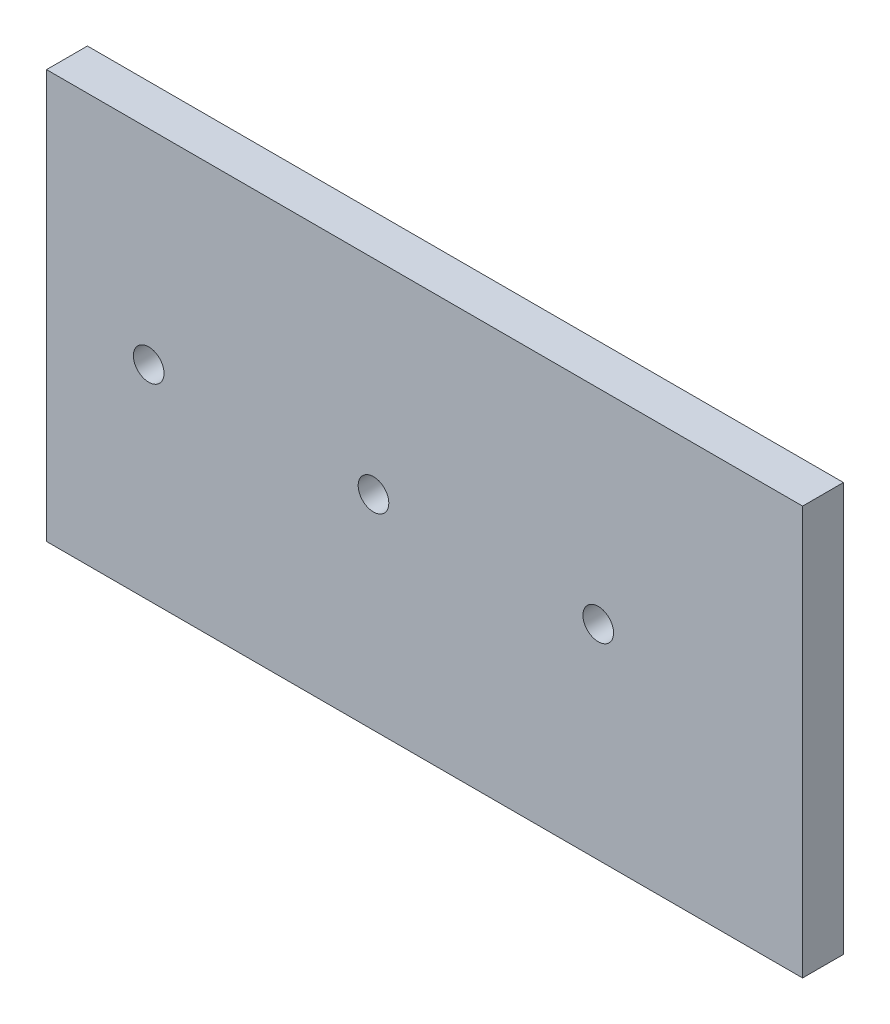
ISO-10303-21;
HEADER;
FILE_DESCRIPTION(('STEP AP214'),'2;1');
FILE_NAME('part.step','',(''),(''),'','','');
FILE_SCHEMA(('AUTOMOTIVE_DESIGN { 1 0 10303 214 1 1 1 1 }'));
ENDSEC;
DATA;
#1=APPLICATION_CONTEXT('core data for automotive mechanical design processes');
#2=APPLICATION_PROTOCOL_DEFINITION('international standard','automotive_design',2000,#1);
#3=PRODUCT_CONTEXT('',#1,'mechanical');
#4=PRODUCT('Part','Part','',(#3));
#5=PRODUCT_RELATED_PRODUCT_CATEGORY('part','',(#4));
#6=PRODUCT_DEFINITION_FORMATION('','',#4);
#7=PRODUCT_DEFINITION_CONTEXT('part definition',#1,'design');
#8=PRODUCT_DEFINITION('design','',#6,#7);
#9=PRODUCT_DEFINITION_SHAPE('','',#8);
#10=(LENGTH_UNIT() NAMED_UNIT(*) SI_UNIT(.MILLI.,.METRE.));
#11=(NAMED_UNIT(*) PLANE_ANGLE_UNIT() SI_UNIT($,.RADIAN.));
#12=(NAMED_UNIT(*) SI_UNIT($,.STERADIAN.) SOLID_ANGLE_UNIT());
#13=UNCERTAINTY_MEASURE_WITH_UNIT(LENGTH_MEASURE(1.E-05),#10,'distance_accuracy_value','');
#14=(GEOMETRIC_REPRESENTATION_CONTEXT(3) GLOBAL_UNCERTAINTY_ASSIGNED_CONTEXT((#13)) GLOBAL_UNIT_ASSIGNED_CONTEXT((#10,
#11,#12)) REPRESENTATION_CONTEXT('',''));
#15=CARTESIAN_POINT('',(0.,0.,0.));
#16=DIRECTION('',(0.,0.,1.));
#17=DIRECTION('',(1.,0.,0.));
#18=AXIS2_PLACEMENT_3D('',#15,#16,#17);
#19=CARTESIAN_POINT('',(0.,0.,12.7));
#20=DIRECTION('',(0.,0.,-1.));
#21=DIRECTION('',(-1.,0.,0.));
#22=AXIS2_PLACEMENT_3D('',#19,#20,#21);
#23=PLANE('',#22);
#24=DIRECTION('',(0.,-1.,0.));
#25=VECTOR('',#24,1.);
#26=CARTESIAN_POINT('',(0.,0.,12.7));
#27=LINE('',#26,#25);
#28=CARTESIAN_POINT('',(0.,127.,12.7));
#29=VERTEX_POINT('',#28);
#30=CARTESIAN_POINT('',(0.,0.,12.7));
#31=VERTEX_POINT('',#30);
#32=EDGE_CURVE('E92',#29,#31,#27,.T.);
#33=ORIENTED_EDGE('',*,*,#32,.T.);
#34=DIRECTION('',(1.,0.,0.));
#35=VECTOR('',#34,1.);
#36=CARTESIAN_POINT('',(0.,0.,12.7));
#37=LINE('',#36,#35);
#38=CARTESIAN_POINT('',(234.95,0.,12.7));
#39=VERTEX_POINT('',#38);
#40=EDGE_CURVE('E87',#31,#39,#37,.T.);
#41=ORIENTED_EDGE('',*,*,#40,.T.);
#42=DIRECTION('',(0.,1.,0.));
#43=VECTOR('',#42,1.);
#44=CARTESIAN_POINT('',(234.95,0.,12.7));
#45=LINE('',#44,#43);
#46=CARTESIAN_POINT('',(234.95,127.,12.7));
#47=VERTEX_POINT('',#46);
#48=EDGE_CURVE('E90',#39,#47,#45,.T.);
#49=ORIENTED_EDGE('',*,*,#48,.T.);
#50=DIRECTION('',(-1.,0.,0.));
#51=VECTOR('',#50,1.);
#52=CARTESIAN_POINT('',(0.,127.,12.7));
#53=LINE('',#52,#51);
#54=EDGE_CURVE('E57',#47,#29,#53,.T.);
#55=ORIENTED_EDGE('',*,*,#54,.T.);
#56=EDGE_LOOP('',(#33,#41,#49,#55));
#57=FACE_BOUND('',#56,.T.);
#58=CARTESIAN_POINT('',(31.75,63.5,12.7));
#59=DIRECTION('',(0.,0.,1.));
#60=DIRECTION('',(1.,0.,0.));
#61=AXIS2_PLACEMENT_3D('',#58,#59,#60);
#62=CIRCLE('',#61,4.7625);
#63=CARTESIAN_POINT('',(36.5125,63.5,12.7));
#64=VERTEX_POINT('',#63);
#65=EDGE_CURVE('E112',#64,#64,#62,.T.);
#66=ORIENTED_EDGE('',*,*,#65,.F.);
#67=EDGE_LOOP('',(#66));
#68=FACE_BOUND('',#67,.T.);
#69=CARTESIAN_POINT('',(101.6,63.5,12.7));
#70=DIRECTION('',(0.,0.,1.));
#71=DIRECTION('',(1.,0.,0.));
#72=AXIS2_PLACEMENT_3D('',#69,#70,#71);
#73=CIRCLE('',#72,4.76249999999998);
#74=CARTESIAN_POINT('',(106.3625,63.5,12.7));
#75=VERTEX_POINT('',#74);
#76=EDGE_CURVE('E134',#75,#75,#73,.T.);
#77=ORIENTED_EDGE('',*,*,#76,.F.);
#78=EDGE_LOOP('',(#77));
#79=FACE_BOUND('',#78,.T.);
#80=CARTESIAN_POINT('',(171.45,63.5,12.7));
#81=DIRECTION('',(0.,0.,1.));
#82=DIRECTION('',(1.,0.,0.));
#83=AXIS2_PLACEMENT_3D('',#80,#81,#82);
#84=CIRCLE('',#83,4.76249999999998);
#85=CARTESIAN_POINT('',(176.2125,63.5,12.7));
#86=VERTEX_POINT('',#85);
#87=EDGE_CURVE('E142',#86,#86,#84,.T.);
#88=ORIENTED_EDGE('',*,*,#87,.F.);
#89=EDGE_LOOP('',(#88));
#90=FACE_BOUND('',#89,.T.);
#91=ADVANCED_FACE('F39',(#57,#68,#79,#90),#23,.F.);
#92=CARTESIAN_POINT('',(0.,0.,0.));
#93=DIRECTION('',(0.,0.,-1.));
#94=DIRECTION('',(-1.,0.,0.));
#95=AXIS2_PLACEMENT_3D('',#92,#93,#94);
#96=PLANE('',#95);
#97=CARTESIAN_POINT('',(101.6,63.5,0.));
#98=DIRECTION('',(0.,0.,1.));
#99=DIRECTION('',(1.,0.,0.));
#100=AXIS2_PLACEMENT_3D('',#97,#98,#99);
#101=CIRCLE('',#100,4.76249999999998);
#102=CARTESIAN_POINT('',(106.3625,63.5,0.));
#103=VERTEX_POINT('',#102);
#104=EDGE_CURVE('E138',#103,#103,#101,.T.);
#105=ORIENTED_EDGE('',*,*,#104,.T.);
#106=EDGE_LOOP('',(#105));
#107=FACE_BOUND('',#106,.T.);
#108=DIRECTION('',(0.,-1.,0.));
#109=VECTOR('',#108,1.);
#110=CARTESIAN_POINT('',(0.,0.,0.));
#111=LINE('',#110,#109);
#112=CARTESIAN_POINT('',(0.,127.,0.));
#113=VERTEX_POINT('',#112);
#114=CARTESIAN_POINT('',(0.,0.,0.));
#115=VERTEX_POINT('',#114);
#116=EDGE_CURVE('E108',#113,#115,#111,.T.);
#117=ORIENTED_EDGE('',*,*,#116,.F.);
#118=DIRECTION('',(-1.,0.,0.));
#119=VECTOR('',#118,1.);
#120=CARTESIAN_POINT('',(0.,127.,0.));
#121=LINE('',#120,#119);
#122=CARTESIAN_POINT('',(234.95,127.,0.));
#123=VERTEX_POINT('',#122);
#124=EDGE_CURVE('E80',#123,#113,#121,.T.);
#125=ORIENTED_EDGE('',*,*,#124,.F.);
#126=DIRECTION('',(0.,1.,0.));
#127=VECTOR('',#126,1.);
#128=CARTESIAN_POINT('',(234.95,0.,0.));
#129=LINE('',#128,#127);
#130=CARTESIAN_POINT('',(234.95,0.,0.));
#131=VERTEX_POINT('',#130);
#132=EDGE_CURVE('E74',#131,#123,#129,.T.);
#133=ORIENTED_EDGE('',*,*,#132,.F.);
#134=DIRECTION('',(1.,0.,0.));
#135=VECTOR('',#134,1.);
#136=CARTESIAN_POINT('',(0.,0.,0.));
#137=LINE('',#136,#135);
#138=EDGE_CURVE('E97',#115,#131,#137,.T.);
#139=ORIENTED_EDGE('',*,*,#138,.F.);
#140=EDGE_LOOP('',(#117,#125,#133,#139));
#141=FACE_BOUND('',#140,.T.);
#142=CARTESIAN_POINT('',(31.75,63.5,0.));
#143=DIRECTION('',(0.,0.,1.));
#144=DIRECTION('',(1.,0.,0.));
#145=AXIS2_PLACEMENT_3D('',#142,#143,#144);
#146=CIRCLE('',#145,4.7625);
#147=CARTESIAN_POINT('',(36.5125,63.5,0.));
#148=VERTEX_POINT('',#147);
#149=EDGE_CURVE('E130',#148,#148,#146,.T.);
#150=ORIENTED_EDGE('',*,*,#149,.T.);
#151=EDGE_LOOP('',(#150));
#152=FACE_BOUND('',#151,.T.);
#153=CARTESIAN_POINT('',(171.45,63.5,0.));
#154=DIRECTION('',(0.,0.,1.));
#155=DIRECTION('',(1.,0.,0.));
#156=AXIS2_PLACEMENT_3D('',#153,#154,#155);
#157=CIRCLE('',#156,4.76249999999998);
#158=CARTESIAN_POINT('',(176.2125,63.5,0.));
#159=VERTEX_POINT('',#158);
#160=EDGE_CURVE('E146',#159,#159,#157,.T.);
#161=ORIENTED_EDGE('',*,*,#160,.T.);
#162=EDGE_LOOP('',(#161));
#163=FACE_BOUND('',#162,.T.);
#164=ADVANCED_FACE('F125',(#107,#141,#152,#163),#96,.T.);
#165=CARTESIAN_POINT('',(0.,0.,12.7));
#166=DIRECTION('',(1.,0.,0.));
#167=DIRECTION('',(0.,0.,-1.));
#168=AXIS2_PLACEMENT_3D('',#165,#166,#167);
#169=PLANE('',#168);
#170=ORIENTED_EDGE('',*,*,#116,.T.);
#171=DIRECTION('',(0.,0.,-1.));
#172=VECTOR('',#171,1.);
#173=CARTESIAN_POINT('',(0.,0.,12.7));
#174=LINE('',#173,#172);
#175=EDGE_CURVE('E11',#31,#115,#174,.T.);
#176=ORIENTED_EDGE('',*,*,#175,.F.);
#177=ORIENTED_EDGE('',*,*,#32,.F.);
#178=DIRECTION('',(0.,0.,-1.));
#179=VECTOR('',#178,1.);
#180=CARTESIAN_POINT('',(0.,127.,12.7));
#181=LINE('',#180,#179);
#182=EDGE_CURVE('E104',#29,#113,#181,.T.);
#183=ORIENTED_EDGE('',*,*,#182,.T.);
#184=EDGE_LOOP('',(#170,#176,#177,#183));
#185=FACE_BOUND('',#184,.T.);
#186=ADVANCED_FACE('F41',(#185),#169,.F.);
#187=CARTESIAN_POINT('',(0.,0.,12.7));
#188=DIRECTION('',(0.,1.,0.));
#189=DIRECTION('',(0.,0.,1.));
#190=AXIS2_PLACEMENT_3D('',#187,#188,#189);
#191=PLANE('',#190);
#192=ORIENTED_EDGE('',*,*,#138,.T.);
#193=DIRECTION('',(0.,0.,-1.));
#194=VECTOR('',#193,1.);
#195=CARTESIAN_POINT('',(234.95,0.,12.7));
#196=LINE('',#195,#194);
#197=EDGE_CURVE('E49',#39,#131,#196,.T.);
#198=ORIENTED_EDGE('',*,*,#197,.F.);
#199=ORIENTED_EDGE('',*,*,#40,.F.);
#200=ORIENTED_EDGE('',*,*,#175,.T.);
#201=EDGE_LOOP('',(#192,#198,#199,#200));
#202=FACE_BOUND('',#201,.T.);
#203=ADVANCED_FACE('F96',(#202),#191,.F.);
#204=CARTESIAN_POINT('',(234.95,0.,12.7));
#205=DIRECTION('',(-1.,0.,0.));
#206=DIRECTION('',(0.,0.,1.));
#207=AXIS2_PLACEMENT_3D('',#204,#205,#206);
#208=PLANE('',#207);
#209=ORIENTED_EDGE('',*,*,#132,.T.);
#210=DIRECTION('',(0.,0.,-1.));
#211=VECTOR('',#210,1.);
#212=CARTESIAN_POINT('',(234.95,127.,12.7));
#213=LINE('',#212,#211);
#214=EDGE_CURVE('E99',#47,#123,#213,.T.);
#215=ORIENTED_EDGE('',*,*,#214,.F.);
#216=ORIENTED_EDGE('',*,*,#48,.F.);
#217=ORIENTED_EDGE('',*,*,#197,.T.);
#218=EDGE_LOOP('',(#209,#215,#216,#217));
#219=FACE_BOUND('',#218,.T.);
#220=ADVANCED_FACE('F100',(#219),#208,.F.);
#221=CARTESIAN_POINT('',(0.,127.,12.7));
#222=DIRECTION('',(0.,-1.,0.));
#223=DIRECTION('',(0.,0.,-1.));
#224=AXIS2_PLACEMENT_3D('',#221,#222,#223);
#225=PLANE('',#224);
#226=ORIENTED_EDGE('',*,*,#124,.T.);
#227=ORIENTED_EDGE('',*,*,#182,.F.);
#228=ORIENTED_EDGE('',*,*,#54,.F.);
#229=ORIENTED_EDGE('',*,*,#214,.T.);
#230=EDGE_LOOP('',(#226,#227,#228,#229));
#231=FACE_BOUND('',#230,.T.);
#232=ADVANCED_FACE('F122',(#231),#225,.F.);
#233=CARTESIAN_POINT('',(31.75,63.5,12.7));
#234=DIRECTION('',(0.,0.,-1.));
#235=DIRECTION('',(-1.,0.,0.));
#236=AXIS2_PLACEMENT_3D('',#233,#234,#235);
#237=CYLINDRICAL_SURFACE('',#236,4.7625);
#238=ORIENTED_EDGE('',*,*,#65,.T.);
#239=EDGE_LOOP('',(#238));
#240=FACE_BOUND('',#239,.T.);
#241=ORIENTED_EDGE('',*,*,#149,.F.);
#242=EDGE_LOOP('',(#241));
#243=FACE_BOUND('',#242,.T.);
#244=ADVANCED_FACE('F165',(#240,#243),#237,.F.);
#245=CARTESIAN_POINT('',(101.6,63.5,12.7));
#246=DIRECTION('',(0.,0.,-1.));
#247=DIRECTION('',(-1.,0.,0.));
#248=AXIS2_PLACEMENT_3D('',#245,#246,#247);
#249=CYLINDRICAL_SURFACE('',#248,4.76249999999998);
#250=ORIENTED_EDGE('',*,*,#76,.T.);
#251=EDGE_LOOP('',(#250));
#252=FACE_BOUND('',#251,.T.);
#253=ORIENTED_EDGE('',*,*,#104,.F.);
#254=EDGE_LOOP('',(#253));
#255=FACE_BOUND('',#254,.T.);
#256=ADVANCED_FACE('F211',(#252,#255),#249,.F.);
#257=CARTESIAN_POINT('',(171.45,63.5,12.7));
#258=DIRECTION('',(0.,0.,-1.));
#259=DIRECTION('',(-1.,0.,0.));
#260=AXIS2_PLACEMENT_3D('',#257,#258,#259);
#261=CYLINDRICAL_SURFACE('',#260,4.76249999999998);
#262=ORIENTED_EDGE('',*,*,#87,.T.);
#263=EDGE_LOOP('',(#262));
#264=FACE_BOUND('',#263,.T.);
#265=ORIENTED_EDGE('',*,*,#160,.F.);
#266=EDGE_LOOP('',(#265));
#267=FACE_BOUND('',#266,.T.);
#268=ADVANCED_FACE('F154',(#264,#267),#261,.F.);
#269=CLOSED_SHELL('',(#91,#164,#186,#203,#220,#232,#244,#256,#268));
#270=MANIFOLD_SOLID_BREP('B2',#269);
#271=ADVANCED_BREP_SHAPE_REPRESENTATION('',(#18,#270),#14);
#272=SHAPE_DEFINITION_REPRESENTATION(#9,#271);
ENDSEC;
END-ISO-10303-21;
